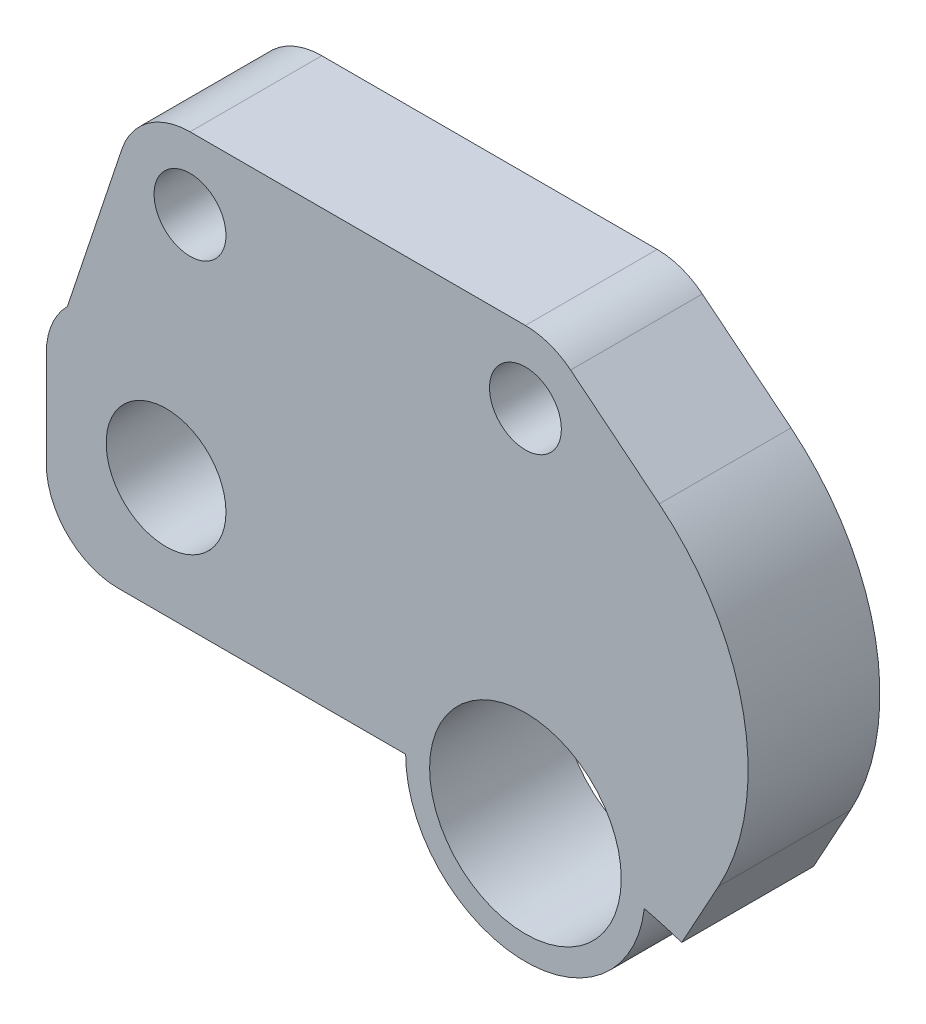
ISO-10303-21;
HEADER;
FILE_DESCRIPTION(('STEP AP214'),'2;1');
FILE_NAME('part.step','',(''),(''),'','','');
FILE_SCHEMA(('AUTOMOTIVE_DESIGN { 1 0 10303 214 1 1 1 1 }'));
ENDSEC;
DATA;
#1=APPLICATION_CONTEXT('core data for automotive mechanical design processes');
#2=APPLICATION_PROTOCOL_DEFINITION('international standard','automotive_design',2000,#1);
#3=PRODUCT_CONTEXT('',#1,'mechanical');
#4=PRODUCT('Part','Part','',(#3));
#5=PRODUCT_RELATED_PRODUCT_CATEGORY('part','',(#4));
#6=PRODUCT_DEFINITION_FORMATION('','',#4);
#7=PRODUCT_DEFINITION_CONTEXT('part definition',#1,'design');
#8=PRODUCT_DEFINITION('design','',#6,#7);
#9=PRODUCT_DEFINITION_SHAPE('','',#8);
#10=(LENGTH_UNIT() NAMED_UNIT(*) SI_UNIT(.MILLI.,.METRE.));
#11=(NAMED_UNIT(*) PLANE_ANGLE_UNIT() SI_UNIT($,.RADIAN.));
#12=(NAMED_UNIT(*) SI_UNIT($,.STERADIAN.) SOLID_ANGLE_UNIT());
#13=UNCERTAINTY_MEASURE_WITH_UNIT(LENGTH_MEASURE(1.E-05),#10,'distance_accuracy_value','');
#14=(GEOMETRIC_REPRESENTATION_CONTEXT(3) GLOBAL_UNCERTAINTY_ASSIGNED_CONTEXT((#13)) GLOBAL_UNIT_ASSIGNED_CONTEXT((#10,
#11,#12)) REPRESENTATION_CONTEXT('',''));
#15=CARTESIAN_POINT('',(0.,0.,0.));
#16=DIRECTION('',(0.,0.,1.));
#17=DIRECTION('',(1.,0.,0.));
#18=AXIS2_PLACEMENT_3D('',#15,#16,#17);
#19=CARTESIAN_POINT('',(0.,0.,5.5));
#20=DIRECTION('',(0.,0.,-1.));
#21=DIRECTION('',(-1.,0.,0.));
#22=AXIS2_PLACEMENT_3D('',#19,#20,#21);
#23=CYLINDRICAL_SURFACE('',#22,20.95);
#24=CARTESIAN_POINT('',(0.,0.,0.));
#25=DIRECTION('',(0.,0.,1.));
#26=DIRECTION('',(1.,0.,0.));
#27=AXIS2_PLACEMENT_3D('',#24,#25,#26);
#28=CIRCLE('',#27,20.95);
#29=CARTESIAN_POINT('',(6.52630372987979,19.90753273576,0.));
#30=VERTEX_POINT('',#29);
#31=CARTESIAN_POINT('',(4.96427219059639,20.3533412887828,0.));
#32=VERTEX_POINT('',#31);
#33=EDGE_CURVE('E146',#30,#32,#28,.T.);
#34=ORIENTED_EDGE('',*,*,#33,.F.);
#35=DIRECTION('',(0.,0.,1.));
#36=VECTOR('',#35,1.);
#37=CARTESIAN_POINT('',(6.52630372987979,19.90753273576,-4.5));
#38=LINE('',#37,#36);
#39=CARTESIAN_POINT('',(6.52630372987979,19.90753273576,5.5));
#40=VERTEX_POINT('',#39);
#41=EDGE_CURVE('E135',#30,#40,#38,.T.);
#42=ORIENTED_EDGE('',*,*,#41,.T.);
#43=CARTESIAN_POINT('',(0.,0.,5.5));
#44=DIRECTION('',(0.,0.,1.));
#45=DIRECTION('',(1.,0.,0.));
#46=AXIS2_PLACEMENT_3D('',#43,#44,#45);
#47=CIRCLE('',#46,20.95);
#48=CARTESIAN_POINT('',(4.96427219059639,20.3533412887828,5.5));
#49=VERTEX_POINT('',#48);
#50=EDGE_CURVE('E144',#40,#49,#47,.T.);
#51=ORIENTED_EDGE('',*,*,#50,.T.);
#52=DIRECTION('',(0.,0.,-1.));
#53=VECTOR('',#52,1.);
#54=CARTESIAN_POINT('',(4.96427219059639,20.3533412887828,5.5));
#55=LINE('',#54,#53);
#56=EDGE_CURVE('E192',#49,#32,#55,.T.);
#57=ORIENTED_EDGE('',*,*,#56,.T.);
#58=EDGE_LOOP('',(#34,#42,#51,#57));
#59=FACE_BOUND('',#58,.T.);
#60=ADVANCED_FACE('F37',(#59),#23,.F.);
#61=CARTESIAN_POINT('',(19.4651242928461,24.0626564673157,5.5));
#62=DIRECTION('',(0.628921624970796,0.777468706536857,0.));
#63=DIRECTION('',(-0.777468706536857,0.628921624970796,0.));
#64=AXIS2_PLACEMENT_3D('',#61,#62,#63);
#65=PLANE('',#64);
#66=DIRECTION('',(0.777468706536857,-0.628921624970796,0.));
#67=VECTOR('',#66,1.);
#68=CARTESIAN_POINT('',(19.4651242928461,24.0626564673157,5.5));
#69=LINE('',#68,#67);
#70=CARTESIAN_POINT('',(1.88676487491238,38.2824061196106,5.5));
#71=VERTEX_POINT('',#70);
#72=CARTESIAN_POINT('',(5.58539292199624,35.2904565504812,5.5));
#73=VERTEX_POINT('',#72);
#74=EDGE_CURVE('E154',#71,#73,#69,.T.);
#75=ORIENTED_EDGE('',*,*,#74,.T.);
#76=DIRECTION('',(0.,0.,1.));
#77=VECTOR('',#76,1.);
#78=CARTESIAN_POINT('',(5.58539292199625,35.2904565504812,5.5));
#79=LINE('',#78,#77);
#80=CARTESIAN_POINT('',(5.58539292199624,35.2904565504812,0.));
#81=VERTEX_POINT('',#80);
#82=EDGE_CURVE('E45',#73,#81,#79,.F.);
#83=ORIENTED_EDGE('',*,*,#82,.T.);
#84=DIRECTION('',(0.777468706536857,-0.628921624970796,0.));
#85=VECTOR('',#84,1.);
#86=CARTESIAN_POINT('',(19.4651242928461,24.0626564673157,0.));
#87=LINE('',#86,#85);
#88=CARTESIAN_POINT('',(1.88676487491238,38.2824061196106,0.));
#89=VERTEX_POINT('',#88);
#90=EDGE_CURVE('E199',#89,#81,#87,.T.);
#91=ORIENTED_EDGE('',*,*,#90,.F.);
#92=DIRECTION('',(0.,0.,-1.));
#93=VECTOR('',#92,1.);
#94=CARTESIAN_POINT('',(1.88676487491238,38.2824061196106,5.5));
#95=LINE('',#94,#93);
#96=EDGE_CURVE('E253',#71,#89,#95,.T.);
#97=ORIENTED_EDGE('',*,*,#96,.F.);
#98=EDGE_LOOP('',(#75,#83,#91,#97));
#99=FACE_BOUND('',#98,.T.);
#100=ADVANCED_FACE('F263',(#99),#65,.T.);
#101=CARTESIAN_POINT('',(0.,0.,5.5));
#102=DIRECTION('',(0.,0.,1.));
#103=DIRECTION('',(1.,0.,0.));
#104=AXIS2_PLACEMENT_3D('',#101,#102,#103);
#105=PLANE('',#104);
#106=CARTESIAN_POINT('',(-15.,25.95,5.5));
#107=DIRECTION('',(0.,0.,1.));
#108=DIRECTION('',(1.,0.,0.));
#109=AXIS2_PLACEMENT_3D('',#106,#107,#108);
#110=CIRCLE('',#109,2.5);
#111=CARTESIAN_POINT('',(-12.5,25.95,5.5));
#112=VERTEX_POINT('',#111);
#113=EDGE_CURVE('E160',#112,#112,#110,.T.);
#114=ORIENTED_EDGE('',*,*,#113,.F.);
#115=EDGE_LOOP('',(#114));
#116=FACE_BOUND('',#115,.T.);
#117=CARTESIAN_POINT('',(0.,20.95,5.5));
#118=DIRECTION('',(0.,0.,1.));
#119=DIRECTION('',(1.,0.,0.));
#120=AXIS2_PLACEMENT_3D('',#117,#118,#119);
#121=CIRCLE('',#120,4.);
#122=CARTESIAN_POINT('',(4.,20.95,5.5));
#123=VERTEX_POINT('',#122);
#124=EDGE_CURVE('E155',#123,#123,#121,.T.);
#125=ORIENTED_EDGE('',*,*,#124,.F.);
#126=EDGE_LOOP('',(#125));
#127=FACE_BOUND('',#126,.T.);
#128=CARTESIAN_POINT('',(-14.,35.95,5.5));
#129=DIRECTION('',(0.,0.,1.));
#130=DIRECTION('',(1.,0.,0.));
#131=AXIS2_PLACEMENT_3D('',#128,#129,#130);
#132=CIRCLE('',#131,1.5);
#133=CARTESIAN_POINT('',(-12.5,35.95,5.5));
#134=VERTEX_POINT('',#133);
#135=EDGE_CURVE('E186',#134,#134,#132,.T.);
#136=ORIENTED_EDGE('',*,*,#135,.F.);
#137=EDGE_LOOP('',(#136));
#138=FACE_BOUND('',#137,.T.);
#139=CARTESIAN_POINT('',(0.,35.95,5.5));
#140=DIRECTION('',(0.,0.,1.));
#141=DIRECTION('',(1.,0.,0.));
#142=AXIS2_PLACEMENT_3D('',#139,#140,#141);
#143=CIRCLE('',#142,1.5);
#144=CARTESIAN_POINT('',(1.5,35.95,5.5));
#145=VERTEX_POINT('',#144);
#146=EDGE_CURVE('E189',#145,#145,#143,.T.);
#147=ORIENTED_EDGE('',*,*,#146,.F.);
#148=EDGE_LOOP('',(#147));
#149=FACE_BOUND('',#148,.T.);
#150=DIRECTION('',(0.481449788710893,0.876473673848928,0.));
#151=VECTOR('',#150,1.);
#152=CARTESIAN_POINT('',(-3.38699580250888,1.86048761318945,5.5));
#153=LINE('',#152,#151);
#154=CARTESIAN_POINT('',(8.06091341077757,22.7012715980037,5.5));
#155=VERTEX_POINT('',#154);
#156=EDGE_CURVE('E131',#40,#155,#153,.T.);
#157=ORIENTED_EDGE('',*,*,#156,.T.);
#158=CARTESIAN_POINT('',(-0.703823327711713,27.5157694851126,5.5));
#159=DIRECTION('',(0.,0.,1.));
#160=DIRECTION('',(1.,0.,0.));
#161=AXIS2_PLACEMENT_3D('',#158,#159,#160);
#162=CIRCLE('',#161,10.);
#163=EDGE_CURVE('E59',#155,#73,#162,.T.);
#164=ORIENTED_EDGE('',*,*,#163,.T.);
#165=ORIENTED_EDGE('',*,*,#74,.F.);
#166=CARTESIAN_POINT('',(0.,35.95,5.5));
#167=DIRECTION('',(0.,0.,1.));
#168=DIRECTION('',(1.,0.,0.));
#169=AXIS2_PLACEMENT_3D('',#166,#167,#168);
#170=CIRCLE('',#169,3.);
#171=CARTESIAN_POINT('',(0.,38.95,5.5));
#172=VERTEX_POINT('',#171);
#173=EDGE_CURVE('E157',#71,#172,#170,.T.);
#174=ORIENTED_EDGE('',*,*,#173,.T.);
#175=DIRECTION('',(1.,0.,0.));
#176=VECTOR('',#175,1.);
#177=CARTESIAN_POINT('',(0.,38.95,5.5));
#178=LINE('',#177,#176);
#179=CARTESIAN_POINT('',(-14.,38.95,5.5));
#180=VERTEX_POINT('',#179);
#181=EDGE_CURVE('E165',#180,#172,#178,.T.);
#182=ORIENTED_EDGE('',*,*,#181,.F.);
#183=CARTESIAN_POINT('',(-14.,35.95,5.5));
#184=DIRECTION('',(0.,0.,1.));
#185=DIRECTION('',(1.,0.,0.));
#186=AXIS2_PLACEMENT_3D('',#183,#184,#185);
#187=CIRCLE('',#186,3.);
#188=CARTESIAN_POINT('',(-16.846114570079,36.8984892482173,5.5));
#189=VERTEX_POINT('',#188);
#190=EDGE_CURVE('E168',#180,#189,#187,.T.);
#191=ORIENTED_EDGE('',*,*,#190,.T.);
#192=DIRECTION('',(-0.316163082739092,-0.948704856693015,0.));
#193=VECTOR('',#192,1.);
#194=CARTESIAN_POINT('',(-26.2297262447128,8.7412550388306,5.5));
#195=LINE('',#194,#193);
#196=CARTESIAN_POINT('',(-19.1213203435596,30.0713203435596,5.5));
#197=VERTEX_POINT('',#196);
#198=EDGE_CURVE('E171',#189,#197,#195,.T.);
#199=ORIENTED_EDGE('',*,*,#198,.T.);
#200=CARTESIAN_POINT('',(-17.,27.95,5.5));
#201=DIRECTION('',(0.,0.,1.));
#202=DIRECTION('',(1.,0.,0.));
#203=AXIS2_PLACEMENT_3D('',#200,#201,#202);
#204=CIRCLE('',#203,3.);
#205=CARTESIAN_POINT('',(-20.,27.95,5.5));
#206=VERTEX_POINT('',#205);
#207=EDGE_CURVE('E174',#197,#206,#204,.T.);
#208=ORIENTED_EDGE('',*,*,#207,.T.);
#209=DIRECTION('',(0.,1.,0.));
#210=VECTOR('',#209,1.);
#211=CARTESIAN_POINT('',(-20.,0.,5.5));
#212=LINE('',#211,#210);
#213=CARTESIAN_POINT('',(-20.,23.95,5.5));
#214=VERTEX_POINT('',#213);
#215=EDGE_CURVE('E176',#214,#206,#212,.T.);
#216=ORIENTED_EDGE('',*,*,#215,.F.);
#217=CARTESIAN_POINT('',(-17.,23.95,5.5));
#218=DIRECTION('',(0.,0.,1.));
#219=DIRECTION('',(1.,0.,0.));
#220=AXIS2_PLACEMENT_3D('',#217,#218,#219);
#221=CIRCLE('',#220,3.);
#222=CARTESIAN_POINT('',(-17.,20.95,5.5));
#223=VERTEX_POINT('',#222);
#224=EDGE_CURVE('E179',#223,#214,#221,.F.);
#225=ORIENTED_EDGE('',*,*,#224,.F.);
#226=DIRECTION('',(-1.,0.,0.));
#227=VECTOR('',#226,1.);
#228=CARTESIAN_POINT('',(0.,20.95,5.5));
#229=LINE('',#228,#227);
#230=CARTESIAN_POINT('',(-5.,20.95,5.5));
#231=VERTEX_POINT('',#230);
#232=EDGE_CURVE('E182',#231,#223,#229,.T.);
#233=ORIENTED_EDGE('',*,*,#232,.F.);
#234=CARTESIAN_POINT('',(0.,20.95,5.5));
#235=DIRECTION('',(0.,0.,1.));
#236=DIRECTION('',(1.,0.,0.));
#237=AXIS2_PLACEMENT_3D('',#234,#235,#236);
#238=CIRCLE('',#237,5.);
#239=EDGE_CURVE('E152',#231,#49,#238,.T.);
#240=ORIENTED_EDGE('',*,*,#239,.T.);
#241=ORIENTED_EDGE('',*,*,#50,.F.);
#242=EDGE_LOOP('',(#157,#164,#165,#174,#182,#191,#199,#208,#216,#225,#233,#240,#241));
#243=FACE_BOUND('',#242,.T.);
#244=ADVANCED_FACE('F149',(#116,#127,#138,#149,#243),#105,.T.);
#245=CARTESIAN_POINT('',(0.,0.,0.));
#246=DIRECTION('',(0.,0.,1.));
#247=DIRECTION('',(1.,0.,0.));
#248=AXIS2_PLACEMENT_3D('',#245,#246,#247);
#249=PLANE('',#248);
#250=CARTESIAN_POINT('',(0.,35.95,0.));
#251=DIRECTION('',(0.,0.,1.));
#252=DIRECTION('',(1.,0.,0.));
#253=AXIS2_PLACEMENT_3D('',#250,#251,#252);
#254=CIRCLE('',#253,1.5);
#255=CARTESIAN_POINT('',(1.5,35.95,0.));
#256=VERTEX_POINT('',#255);
#257=EDGE_CURVE('E231',#256,#256,#254,.T.);
#258=ORIENTED_EDGE('',*,*,#257,.T.);
#259=EDGE_LOOP('',(#258));
#260=FACE_BOUND('',#259,.T.);
#261=CARTESIAN_POINT('',(-14.,35.95,0.));
#262=DIRECTION('',(0.,0.,1.));
#263=DIRECTION('',(1.,0.,0.));
#264=AXIS2_PLACEMENT_3D('',#261,#262,#263);
#265=CIRCLE('',#264,1.5);
#266=CARTESIAN_POINT('',(-12.5,35.95,0.));
#267=VERTEX_POINT('',#266);
#268=EDGE_CURVE('E228',#267,#267,#265,.T.);
#269=ORIENTED_EDGE('',*,*,#268,.T.);
#270=EDGE_LOOP('',(#269));
#271=FACE_BOUND('',#270,.T.);
#272=CARTESIAN_POINT('',(0.,20.95,0.));
#273=DIRECTION('',(0.,0.,1.));
#274=DIRECTION('',(1.,0.,0.));
#275=AXIS2_PLACEMENT_3D('',#272,#273,#274);
#276=CIRCLE('',#275,4.);
#277=CARTESIAN_POINT('',(4.,20.95,0.));
#278=VERTEX_POINT('',#277);
#279=EDGE_CURVE('E195',#278,#278,#276,.T.);
#280=ORIENTED_EDGE('',*,*,#279,.T.);
#281=EDGE_LOOP('',(#280));
#282=FACE_BOUND('',#281,.T.);
#283=CARTESIAN_POINT('',(-15.,25.95,0.));
#284=DIRECTION('',(0.,0.,1.));
#285=DIRECTION('',(1.,0.,0.));
#286=AXIS2_PLACEMENT_3D('',#283,#284,#285);
#287=CIRCLE('',#286,2.5);
#288=CARTESIAN_POINT('',(-12.5,25.95,0.));
#289=VERTEX_POINT('',#288);
#290=EDGE_CURVE('E147',#289,#289,#287,.T.);
#291=ORIENTED_EDGE('',*,*,#290,.T.);
#292=EDGE_LOOP('',(#291));
#293=FACE_BOUND('',#292,.T.);
#294=ORIENTED_EDGE('',*,*,#90,.T.);
#295=CARTESIAN_POINT('',(-0.703823327711713,27.5157694851126,0.));
#296=DIRECTION('',(0.,0.,1.));
#297=DIRECTION('',(1.,0.,0.));
#298=AXIS2_PLACEMENT_3D('',#295,#296,#297);
#299=CIRCLE('',#298,10.);
#300=CARTESIAN_POINT('',(8.06091341077757,22.7012715980037,0.));
#301=VERTEX_POINT('',#300);
#302=EDGE_CURVE('E11',#81,#301,#299,.F.);
#303=ORIENTED_EDGE('',*,*,#302,.T.);
#304=DIRECTION('',(0.481449788710893,0.876473673848928,0.));
#305=VECTOR('',#304,1.);
#306=CARTESIAN_POINT('',(-3.38699580250888,1.86048761318945,0.));
#307=LINE('',#306,#305);
#308=EDGE_CURVE('E255',#30,#301,#307,.T.);
#309=ORIENTED_EDGE('',*,*,#308,.F.);
#310=ORIENTED_EDGE('',*,*,#33,.T.);
#311=CARTESIAN_POINT('',(0.,20.95,0.));
#312=DIRECTION('',(0.,0.,1.));
#313=DIRECTION('',(1.,0.,0.));
#314=AXIS2_PLACEMENT_3D('',#311,#312,#313);
#315=CIRCLE('',#314,5.);
#316=CARTESIAN_POINT('',(-5.,20.95,0.));
#317=VERTEX_POINT('',#316);
#318=EDGE_CURVE('E225',#317,#32,#315,.T.);
#319=ORIENTED_EDGE('',*,*,#318,.F.);
#320=DIRECTION('',(-1.,0.,0.));
#321=VECTOR('',#320,1.);
#322=CARTESIAN_POINT('',(0.,20.95,0.));
#323=LINE('',#322,#321);
#324=CARTESIAN_POINT('',(-17.,20.95,0.));
#325=VERTEX_POINT('',#324);
#326=EDGE_CURVE('E222',#317,#325,#323,.T.);
#327=ORIENTED_EDGE('',*,*,#326,.T.);
#328=CARTESIAN_POINT('',(-17.,23.95,0.));
#329=DIRECTION('',(0.,0.,1.));
#330=DIRECTION('',(1.,0.,0.));
#331=AXIS2_PLACEMENT_3D('',#328,#329,#330);
#332=CIRCLE('',#331,3.);
#333=CARTESIAN_POINT('',(-20.,23.95,0.));
#334=VERTEX_POINT('',#333);
#335=EDGE_CURVE('E219',#325,#334,#332,.F.);
#336=ORIENTED_EDGE('',*,*,#335,.T.);
#337=DIRECTION('',(0.,1.,0.));
#338=VECTOR('',#337,1.);
#339=CARTESIAN_POINT('',(-20.,0.,0.));
#340=LINE('',#339,#338);
#341=CARTESIAN_POINT('',(-20.,27.95,0.));
#342=VERTEX_POINT('',#341);
#343=EDGE_CURVE('E216',#334,#342,#340,.T.);
#344=ORIENTED_EDGE('',*,*,#343,.T.);
#345=CARTESIAN_POINT('',(-17.,27.95,0.));
#346=DIRECTION('',(0.,0.,1.));
#347=DIRECTION('',(1.,0.,0.));
#348=AXIS2_PLACEMENT_3D('',#345,#346,#347);
#349=CIRCLE('',#348,3.);
#350=CARTESIAN_POINT('',(-19.1213203435596,30.0713203435596,0.));
#351=VERTEX_POINT('',#350);
#352=EDGE_CURVE('E213',#351,#342,#349,.T.);
#353=ORIENTED_EDGE('',*,*,#352,.F.);
#354=DIRECTION('',(-0.316163082739092,-0.948704856693015,0.));
#355=VECTOR('',#354,1.);
#356=CARTESIAN_POINT('',(-26.2297262447128,8.7412550388306,0.));
#357=LINE('',#356,#355);
#358=CARTESIAN_POINT('',(-16.846114570079,36.8984892482173,0.));
#359=VERTEX_POINT('',#358);
#360=EDGE_CURVE('E210',#359,#351,#357,.T.);
#361=ORIENTED_EDGE('',*,*,#360,.F.);
#362=CARTESIAN_POINT('',(-14.,35.95,0.));
#363=DIRECTION('',(0.,0.,1.));
#364=DIRECTION('',(1.,0.,0.));
#365=AXIS2_PLACEMENT_3D('',#362,#363,#364);
#366=CIRCLE('',#365,3.);
#367=CARTESIAN_POINT('',(-14.,38.95,0.));
#368=VERTEX_POINT('',#367);
#369=EDGE_CURVE('E207',#368,#359,#366,.T.);
#370=ORIENTED_EDGE('',*,*,#369,.F.);
#371=DIRECTION('',(1.,0.,0.));
#372=VECTOR('',#371,1.);
#373=CARTESIAN_POINT('',(0.,38.95,0.));
#374=LINE('',#373,#372);
#375=CARTESIAN_POINT('',(0.,38.95,0.));
#376=VERTEX_POINT('',#375);
#377=EDGE_CURVE('E204',#368,#376,#374,.T.);
#378=ORIENTED_EDGE('',*,*,#377,.T.);
#379=CARTESIAN_POINT('',(0.,35.95,0.));
#380=DIRECTION('',(0.,0.,1.));
#381=DIRECTION('',(1.,0.,0.));
#382=AXIS2_PLACEMENT_3D('',#379,#380,#381);
#383=CIRCLE('',#382,3.);
#384=EDGE_CURVE('E201',#89,#376,#383,.T.);
#385=ORIENTED_EDGE('',*,*,#384,.F.);
#386=EDGE_LOOP('',(#294,#303,#309,#310,#319,#327,#336,#344,#353,#361,#370,#378,#385));
#387=FACE_BOUND('',#386,.T.);
#388=ADVANCED_FACE('F261',(#260,#271,#282,#293,#387),#249,.F.);
#389=CARTESIAN_POINT('',(0.,35.95,5.5));
#390=DIRECTION('',(0.,0.,-1.));
#391=DIRECTION('',(-1.,0.,0.));
#392=AXIS2_PLACEMENT_3D('',#389,#390,#391);
#393=CYLINDRICAL_SURFACE('',#392,3.);
#394=ORIENTED_EDGE('',*,*,#384,.T.);
#395=DIRECTION('',(0.,0.,-1.));
#396=VECTOR('',#395,1.);
#397=CARTESIAN_POINT('',(0.,38.95,5.5));
#398=LINE('',#397,#396);
#399=EDGE_CURVE('E251',#172,#376,#398,.T.);
#400=ORIENTED_EDGE('',*,*,#399,.F.);
#401=ORIENTED_EDGE('',*,*,#173,.F.);
#402=ORIENTED_EDGE('',*,*,#96,.T.);
#403=EDGE_LOOP('',(#394,#400,#401,#402));
#404=FACE_BOUND('',#403,.T.);
#405=ADVANCED_FACE('F267',(#404),#393,.T.);
#406=CARTESIAN_POINT('',(0.,38.95,5.5));
#407=DIRECTION('',(0.,1.,0.));
#408=DIRECTION('',(0.,0.,1.));
#409=AXIS2_PLACEMENT_3D('',#406,#407,#408);
#410=PLANE('',#409);
#411=ORIENTED_EDGE('',*,*,#377,.F.);
#412=DIRECTION('',(0.,0.,-1.));
#413=VECTOR('',#412,1.);
#414=CARTESIAN_POINT('',(-14.,38.95,5.5));
#415=LINE('',#414,#413);
#416=EDGE_CURVE('E249',#180,#368,#415,.T.);
#417=ORIENTED_EDGE('',*,*,#416,.F.);
#418=ORIENTED_EDGE('',*,*,#181,.T.);
#419=ORIENTED_EDGE('',*,*,#399,.T.);
#420=EDGE_LOOP('',(#411,#417,#418,#419));
#421=FACE_BOUND('',#420,.T.);
#422=ADVANCED_FACE('F273',(#421),#410,.T.);
#423=CARTESIAN_POINT('',(-14.,35.95,5.5));
#424=DIRECTION('',(0.,0.,-1.));
#425=DIRECTION('',(-1.,0.,0.));
#426=AXIS2_PLACEMENT_3D('',#423,#424,#425);
#427=CYLINDRICAL_SURFACE('',#426,3.);
#428=ORIENTED_EDGE('',*,*,#369,.T.);
#429=DIRECTION('',(0.,0.,-1.));
#430=VECTOR('',#429,1.);
#431=CARTESIAN_POINT('',(-16.846114570079,36.8984892482173,5.5));
#432=LINE('',#431,#430);
#433=EDGE_CURVE('E246',#189,#359,#432,.T.);
#434=ORIENTED_EDGE('',*,*,#433,.F.);
#435=ORIENTED_EDGE('',*,*,#190,.F.);
#436=ORIENTED_EDGE('',*,*,#416,.T.);
#437=EDGE_LOOP('',(#428,#434,#435,#436));
#438=FACE_BOUND('',#437,.T.);
#439=ADVANCED_FACE('F276',(#438),#427,.T.);
#440=CARTESIAN_POINT('',(-26.2297262447128,8.7412550388306,5.5));
#441=DIRECTION('',(0.948704856693015,-0.316163082739092,0.));
#442=DIRECTION('',(0.316163082739092,0.948704856693015,0.));
#443=AXIS2_PLACEMENT_3D('',#440,#441,#442);
#444=PLANE('',#443);
#445=ORIENTED_EDGE('',*,*,#360,.T.);
#446=DIRECTION('',(0.,0.,-1.));
#447=VECTOR('',#446,1.);
#448=CARTESIAN_POINT('',(-19.1213203435596,30.0713203435596,5.5));
#449=LINE('',#448,#447);
#450=EDGE_CURVE('E243',#197,#351,#449,.T.);
#451=ORIENTED_EDGE('',*,*,#450,.F.);
#452=ORIENTED_EDGE('',*,*,#198,.F.);
#453=ORIENTED_EDGE('',*,*,#433,.T.);
#454=EDGE_LOOP('',(#445,#451,#452,#453));
#455=FACE_BOUND('',#454,.T.);
#456=ADVANCED_FACE('F278',(#455),#444,.F.);
#457=CARTESIAN_POINT('',(-17.,27.95,5.5));
#458=DIRECTION('',(0.,0.,-1.));
#459=DIRECTION('',(-1.,0.,0.));
#460=AXIS2_PLACEMENT_3D('',#457,#458,#459);
#461=CYLINDRICAL_SURFACE('',#460,3.);
#462=ORIENTED_EDGE('',*,*,#352,.T.);
#463=DIRECTION('',(0.,0.,-1.));
#464=VECTOR('',#463,1.);
#465=CARTESIAN_POINT('',(-20.,27.95,5.5));
#466=LINE('',#465,#464);
#467=EDGE_CURVE('E241',#206,#342,#466,.T.);
#468=ORIENTED_EDGE('',*,*,#467,.F.);
#469=ORIENTED_EDGE('',*,*,#207,.F.);
#470=ORIENTED_EDGE('',*,*,#450,.T.);
#471=EDGE_LOOP('',(#462,#468,#469,#470));
#472=FACE_BOUND('',#471,.T.);
#473=ADVANCED_FACE('F284',(#472),#461,.T.);
#474=CARTESIAN_POINT('',(-20.,0.,5.5));
#475=DIRECTION('',(-1.,0.,0.));
#476=DIRECTION('',(0.,0.,1.));
#477=AXIS2_PLACEMENT_3D('',#474,#475,#476);
#478=PLANE('',#477);
#479=ORIENTED_EDGE('',*,*,#343,.F.);
#480=DIRECTION('',(0.,0.,-1.));
#481=VECTOR('',#480,1.);
#482=CARTESIAN_POINT('',(-20.,23.95,5.5));
#483=LINE('',#482,#481);
#484=EDGE_CURVE('E239',#214,#334,#483,.T.);
#485=ORIENTED_EDGE('',*,*,#484,.F.);
#486=ORIENTED_EDGE('',*,*,#215,.T.);
#487=ORIENTED_EDGE('',*,*,#467,.T.);
#488=EDGE_LOOP('',(#479,#485,#486,#487));
#489=FACE_BOUND('',#488,.T.);
#490=ADVANCED_FACE('F287',(#489),#478,.T.);
#491=CARTESIAN_POINT('',(-17.,23.95,5.5));
#492=DIRECTION('',(0.,0.,-1.));
#493=DIRECTION('',(-1.,0.,0.));
#494=AXIS2_PLACEMENT_3D('',#491,#492,#493);
#495=CYLINDRICAL_SURFACE('',#494,3.);
#496=ORIENTED_EDGE('',*,*,#335,.F.);
#497=DIRECTION('',(0.,0.,-1.));
#498=VECTOR('',#497,1.);
#499=CARTESIAN_POINT('',(-17.,20.95,5.5));
#500=LINE('',#499,#498);
#501=EDGE_CURVE('E237',#223,#325,#500,.T.);
#502=ORIENTED_EDGE('',*,*,#501,.F.);
#503=ORIENTED_EDGE('',*,*,#224,.T.);
#504=ORIENTED_EDGE('',*,*,#484,.T.);
#505=EDGE_LOOP('',(#496,#502,#503,#504));
#506=FACE_BOUND('',#505,.T.);
#507=ADVANCED_FACE('F290',(#506),#495,.T.);
#508=CARTESIAN_POINT('',(0.,20.95,5.5));
#509=DIRECTION('',(0.,-1.,0.));
#510=DIRECTION('',(1.,0.,0.));
#511=AXIS2_PLACEMENT_3D('',#508,#509,#510);
#512=PLANE('',#511);
#513=ORIENTED_EDGE('',*,*,#326,.F.);
#514=DIRECTION('',(0.,0.,-1.));
#515=VECTOR('',#514,1.);
#516=CARTESIAN_POINT('',(-5.,20.95,5.5));
#517=LINE('',#516,#515);
#518=EDGE_CURVE('E235',#231,#317,#517,.T.);
#519=ORIENTED_EDGE('',*,*,#518,.F.);
#520=ORIENTED_EDGE('',*,*,#232,.T.);
#521=ORIENTED_EDGE('',*,*,#501,.T.);
#522=EDGE_LOOP('',(#513,#519,#520,#521));
#523=FACE_BOUND('',#522,.T.);
#524=ADVANCED_FACE('F293',(#523),#512,.T.);
#525=CARTESIAN_POINT('',(-14.,35.95,5.5));
#526=DIRECTION('',(0.,0.,-1.));
#527=DIRECTION('',(-1.,0.,0.));
#528=AXIS2_PLACEMENT_3D('',#525,#526,#527);
#529=CYLINDRICAL_SURFACE('',#528,1.5);
#530=ORIENTED_EDGE('',*,*,#135,.T.);
#531=EDGE_LOOP('',(#530));
#532=FACE_BOUND('',#531,.T.);
#533=ORIENTED_EDGE('',*,*,#268,.F.);
#534=EDGE_LOOP('',(#533));
#535=FACE_BOUND('',#534,.T.);
#536=ADVANCED_FACE('F299',(#532,#535),#529,.F.);
#537=CARTESIAN_POINT('',(0.,20.95,5.5));
#538=DIRECTION('',(0.,0.,-1.));
#539=DIRECTION('',(-1.,0.,0.));
#540=AXIS2_PLACEMENT_3D('',#537,#538,#539);
#541=CYLINDRICAL_SURFACE('',#540,5.);
#542=ORIENTED_EDGE('',*,*,#318,.T.);
#543=ORIENTED_EDGE('',*,*,#56,.F.);
#544=ORIENTED_EDGE('',*,*,#239,.F.);
#545=ORIENTED_EDGE('',*,*,#518,.T.);
#546=EDGE_LOOP('',(#542,#543,#544,#545));
#547=FACE_BOUND('',#546,.T.);
#548=ADVANCED_FACE('F296',(#547),#541,.T.);
#549=CARTESIAN_POINT('',(0.,20.95,5.5));
#550=DIRECTION('',(0.,0.,-1.));
#551=DIRECTION('',(-1.,0.,0.));
#552=AXIS2_PLACEMENT_3D('',#549,#550,#551);
#553=CYLINDRICAL_SURFACE('',#552,4.);
#554=ORIENTED_EDGE('',*,*,#124,.T.);
#555=EDGE_LOOP('',(#554));
#556=FACE_BOUND('',#555,.T.);
#557=ORIENTED_EDGE('',*,*,#279,.F.);
#558=EDGE_LOOP('',(#557));
#559=FACE_BOUND('',#558,.T.);
#560=ADVANCED_FACE('F298',(#556,#559),#553,.F.);
#561=CARTESIAN_POINT('',(-15.,25.95,5.5));
#562=DIRECTION('',(0.,0.,-1.));
#563=DIRECTION('',(-1.,0.,0.));
#564=AXIS2_PLACEMENT_3D('',#561,#562,#563);
#565=CYLINDRICAL_SURFACE('',#564,2.5);
#566=ORIENTED_EDGE('',*,*,#113,.T.);
#567=EDGE_LOOP('',(#566));
#568=FACE_BOUND('',#567,.T.);
#569=ORIENTED_EDGE('',*,*,#290,.F.);
#570=EDGE_LOOP('',(#569));
#571=FACE_BOUND('',#570,.T.);
#572=ADVANCED_FACE('F305',(#568,#571),#565,.F.);
#573=CARTESIAN_POINT('',(0.,35.95,5.5));
#574=DIRECTION('',(0.,0.,-1.));
#575=DIRECTION('',(-1.,0.,0.));
#576=AXIS2_PLACEMENT_3D('',#573,#574,#575);
#577=CYLINDRICAL_SURFACE('',#576,1.5);
#578=ORIENTED_EDGE('',*,*,#146,.T.);
#579=EDGE_LOOP('',(#578));
#580=FACE_BOUND('',#579,.T.);
#581=ORIENTED_EDGE('',*,*,#257,.F.);
#582=EDGE_LOOP('',(#581));
#583=FACE_BOUND('',#582,.T.);
#584=ADVANCED_FACE('F319',(#580,#583),#577,.F.);
#585=CARTESIAN_POINT('',(-3.38699580250888,1.86048761318945,-4.5));
#586=DIRECTION('',(0.876473673848928,-0.481449788710893,0.));
#587=DIRECTION('',(0.481449788710893,0.876473673848928,0.));
#588=AXIS2_PLACEMENT_3D('',#585,#586,#587);
#589=PLANE('',#588);
#590=ORIENTED_EDGE('',*,*,#308,.T.);
#591=DIRECTION('',(0.,0.,1.));
#592=VECTOR('',#591,1.);
#593=CARTESIAN_POINT('',(8.06091341077757,22.7012715980037,-4.5));
#594=LINE('',#593,#592);
#595=EDGE_CURVE('E138',#301,#155,#594,.T.);
#596=ORIENTED_EDGE('',*,*,#595,.T.);
#597=ORIENTED_EDGE('',*,*,#156,.F.);
#598=ORIENTED_EDGE('',*,*,#41,.F.);
#599=EDGE_LOOP('',(#590,#596,#597,#598));
#600=FACE_BOUND('',#599,.T.);
#601=ADVANCED_FACE('F134',(#600),#589,.T.);
#602=CARTESIAN_POINT('',(-0.703823327711713,27.5157694851126,-4.5));
#603=DIRECTION('',(0.,0.,1.));
#604=DIRECTION('',(1.,0.,0.));
#605=AXIS2_PLACEMENT_3D('',#602,#603,#604);
#606=CYLINDRICAL_SURFACE('',#605,10.);
#607=ORIENTED_EDGE('',*,*,#302,.F.);
#608=ORIENTED_EDGE('',*,*,#82,.F.);
#609=ORIENTED_EDGE('',*,*,#163,.F.);
#610=ORIENTED_EDGE('',*,*,#595,.F.);
#611=EDGE_LOOP('',(#607,#608,#609,#610));
#612=FACE_BOUND('',#611,.T.);
#613=ADVANCED_FACE('F39',(#612),#606,.T.);
#614=CLOSED_SHELL('',(#60,#100,#244,#388,#405,#422,#439,#456,#473,#490,#507,#524,#536,#548,#560,
#572,#584,#601,#613));
#615=MANIFOLD_SOLID_BREP('B2',#614);
#616=ADVANCED_BREP_SHAPE_REPRESENTATION('',(#18,#615),#14);
#617=SHAPE_DEFINITION_REPRESENTATION(#9,#616);
ENDSEC;
END-ISO-10303-21;
